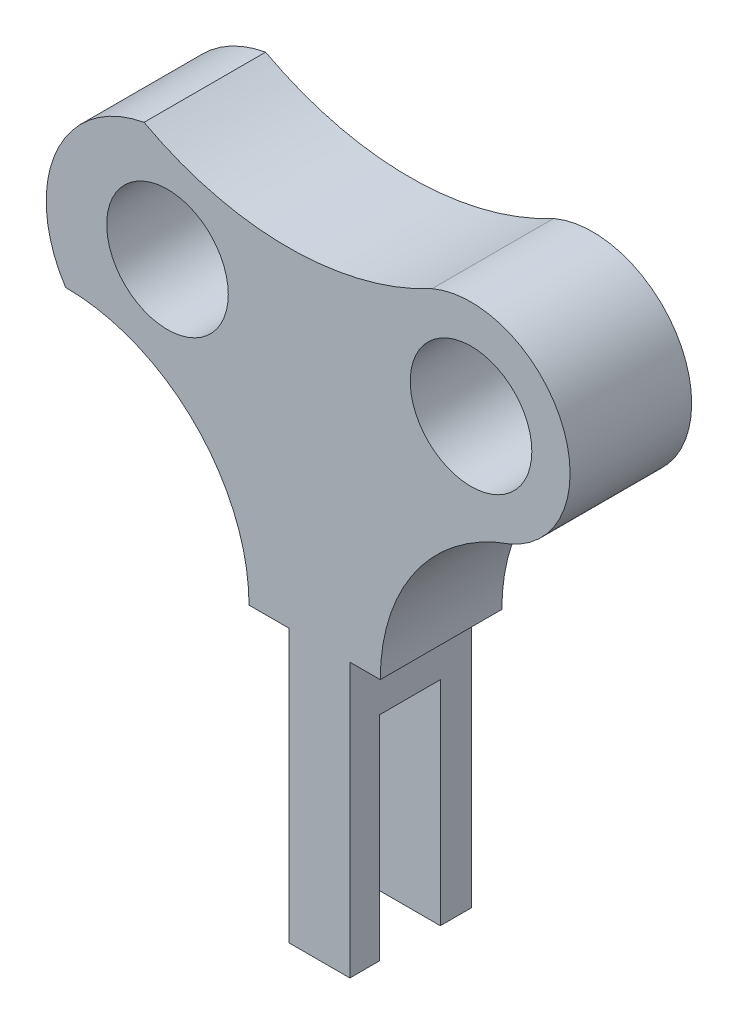
ISO-10303-21;
HEADER;
FILE_DESCRIPTION(('STEP AP214'),'2;1');
FILE_NAME('part.step','',(''),(''),'','','');
FILE_SCHEMA(('AUTOMOTIVE_DESIGN { 1 0 10303 214 1 1 1 1 }'));
ENDSEC;
DATA;
#1=APPLICATION_CONTEXT('core data for automotive mechanical design processes');
#2=APPLICATION_PROTOCOL_DEFINITION('international standard','automotive_design',2000,#1);
#3=PRODUCT_CONTEXT('',#1,'mechanical');
#4=PRODUCT('Part','Part','',(#3));
#5=PRODUCT_RELATED_PRODUCT_CATEGORY('part','',(#4));
#6=PRODUCT_DEFINITION_FORMATION('','',#4);
#7=PRODUCT_DEFINITION_CONTEXT('part definition',#1,'design');
#8=PRODUCT_DEFINITION('design','',#6,#7);
#9=PRODUCT_DEFINITION_SHAPE('','',#8);
#10=(LENGTH_UNIT() NAMED_UNIT(*) SI_UNIT(.MILLI.,.METRE.));
#11=(NAMED_UNIT(*) PLANE_ANGLE_UNIT() SI_UNIT($,.RADIAN.));
#12=(NAMED_UNIT(*) SI_UNIT($,.STERADIAN.) SOLID_ANGLE_UNIT());
#13=UNCERTAINTY_MEASURE_WITH_UNIT(LENGTH_MEASURE(1.E-05),#10,'distance_accuracy_value','');
#14=(GEOMETRIC_REPRESENTATION_CONTEXT(3) GLOBAL_UNCERTAINTY_ASSIGNED_CONTEXT((#13)) GLOBAL_UNIT_ASSIGNED_CONTEXT((#10,
#11,#12)) REPRESENTATION_CONTEXT('',''));
#15=CARTESIAN_POINT('',(0.,0.,0.));
#16=DIRECTION('',(0.,0.,1.));
#17=DIRECTION('',(1.,0.,0.));
#18=AXIS2_PLACEMENT_3D('',#15,#16,#17);
#19=CARTESIAN_POINT('',(54.8930485924395,39.6893929956681,20.));
#20=DIRECTION('',(0.,1.,0.));
#21=DIRECTION('',(0.,0.,1.));
#22=AXIS2_PLACEMENT_3D('',#19,#20,#21);
#23=PLANE('',#22);
#24=DIRECTION('',(0.,0.,-1.));
#25=VECTOR('',#24,1.);
#26=CARTESIAN_POINT('',(54.8930485924395,39.6893929956681,20.));
#27=LINE('',#26,#25);
#28=CARTESIAN_POINT('',(54.8930485924395,39.6893929956681,20.));
#29=VERTEX_POINT('',#28);
#30=CARTESIAN_POINT('',(54.8930485924395,39.6893929956681,15.1346651177182));
#31=VERTEX_POINT('',#30);
#32=EDGE_CURVE('E226',#29,#31,#27,.T.);
#33=ORIENTED_EDGE('',*,*,#32,.T.);
#34=DIRECTION('',(-1.,0.,0.));
#35=VECTOR('',#34,1.);
#36=CARTESIAN_POINT('',(74.8930485924395,39.6893929956681,15.1346651177182));
#37=LINE('',#36,#35);
#38=CARTESIAN_POINT('',(64.8930485924395,39.6893929956681,15.1346651177182));
#39=VERTEX_POINT('',#38);
#40=EDGE_CURVE('E261',#39,#31,#37,.T.);
#41=ORIENTED_EDGE('',*,*,#40,.F.);
#42=DIRECTION('',(0.,0.,-1.));
#43=VECTOR('',#42,1.);
#44=CARTESIAN_POINT('',(64.8930485924395,39.6893929956681,20.));
#45=LINE('',#44,#43);
#46=CARTESIAN_POINT('',(64.8930485924395,39.6893929956681,20.));
#47=VERTEX_POINT('',#46);
#48=EDGE_CURVE('E221',#47,#39,#45,.T.);
#49=ORIENTED_EDGE('',*,*,#48,.F.);
#50=DIRECTION('',(1.,0.,0.));
#51=VECTOR('',#50,1.);
#52=CARTESIAN_POINT('',(54.8930485924395,39.6893929956681,20.));
#53=LINE('',#52,#51);
#54=EDGE_CURVE('E112',#29,#47,#53,.T.);
#55=ORIENTED_EDGE('',*,*,#54,.F.);
#56=EDGE_LOOP('',(#33,#41,#49,#55));
#57=FACE_BOUND('',#56,.T.);
#58=ADVANCED_FACE('F39',(#57),#23,.F.);
#59=CARTESIAN_POINT('',(18.1326794520991,84.5072267477654,20.));
#60=DIRECTION('',(0.,0.,1.));
#61=DIRECTION('',(1.,0.,0.));
#62=AXIS2_PLACEMENT_3D('',#59,#60,#61);
#63=PLANE('',#62);
#64=CARTESIAN_POINT('',(84.8245600380508,129.66706374097,20.));
#65=DIRECTION('',(0.,0.,1.));
#66=DIRECTION('',(1.,0.,0.));
#67=AXIS2_PLACEMENT_3D('',#64,#65,#66);
#68=CIRCLE('',#67,10.);
#69=CARTESIAN_POINT('',(94.8245600380508,129.66706374097,20.));
#70=VERTEX_POINT('',#69);
#71=EDGE_CURVE('E171',#70,#70,#68,.T.);
#72=ORIENTED_EDGE('',*,*,#71,.F.);
#73=EDGE_LOOP('',(#72));
#74=FACE_BOUND('',#73,.T.);
#75=DIRECTION('',(0.,-1.,0.));
#76=VECTOR('',#75,1.);
#77=CARTESIAN_POINT('',(54.8930485924395,39.6893929956681,20.));
#78=LINE('',#77,#76);
#79=CARTESIAN_POINT('',(54.8930485924395,84.5072267477654,20.));
#80=VERTEX_POINT('',#79);
#81=EDGE_CURVE('E197',#80,#29,#78,.T.);
#82=ORIENTED_EDGE('',*,*,#81,.T.);
#83=ORIENTED_EDGE('',*,*,#54,.T.);
#84=DIRECTION('',(0.,1.,0.));
#85=VECTOR('',#84,1.);
#86=CARTESIAN_POINT('',(64.8930485924395,39.6893929956681,20.));
#87=LINE('',#86,#85);
#88=CARTESIAN_POINT('',(64.8930485924395,84.6893929956681,20.));
#89=VERTEX_POINT('',#88);
#90=EDGE_CURVE('E290',#47,#89,#87,.T.);
#91=ORIENTED_EDGE('',*,*,#90,.T.);
#92=DIRECTION('',(1.,0.,0.));
#93=VECTOR('',#92,1.);
#94=CARTESIAN_POINT('',(64.8930485924395,84.6893929956681,20.));
#95=LINE('',#94,#93);
#96=CARTESIAN_POINT('',(69.8930485924395,84.6893929956681,20.));
#97=VERTEX_POINT('',#96);
#98=EDGE_CURVE('E293',#89,#97,#95,.T.);
#99=ORIENTED_EDGE('',*,*,#98,.T.);
#100=CARTESIAN_POINT('',(101.644635643454,84.6893929956681,20.));
#101=DIRECTION('',(0.,0.,-1.));
#102=DIRECTION('',(-1.,0.,0.));
#103=AXIS2_PLACEMENT_3D('',#100,#101,#102);
#104=CIRCLE('',#103,31.7515870510142);
#105=CARTESIAN_POINT('',(91.2266127308357,114.683193669312,20.));
#106=VERTEX_POINT('',#105);
#107=EDGE_CURVE('E296',#97,#106,#104,.T.);
#108=ORIENTED_EDGE('',*,*,#107,.T.);
#109=CARTESIAN_POINT('',(84.8245600380508,129.66706374097,20.));
#110=DIRECTION('',(0.,0.,1.));
#111=DIRECTION('',(1.,0.,0.));
#112=AXIS2_PLACEMENT_3D('',#109,#110,#111);
#113=CIRCLE('',#112,16.29425177802);
#114=CARTESIAN_POINT('',(78.422507345266,144.650933812628,20.));
#115=VERTEX_POINT('',#114);
#116=EDGE_CURVE('E299',#106,#115,#113,.T.);
#117=ORIENTED_EDGE('',*,*,#116,.T.);
#118=CARTESIAN_POINT('',(54.7296652003077,188.681028419545,20.));
#119=DIRECTION('',(0.,0.,-1.));
#120=DIRECTION('',(1.,0.,0.));
#121=AXIS2_PLACEMENT_3D('',#118,#119,#120);
#122=CIRCLE('',#121,50.0000000000001);
#123=CARTESIAN_POINT('',(31.0368230553493,144.650933812628,20.));
#124=VERTEX_POINT('',#123);
#125=EDGE_CURVE('E141',#115,#124,#122,.T.);
#126=ORIENTED_EDGE('',*,*,#125,.T.);
#127=CARTESIAN_POINT('',(34.5196876056928,125.389068644848,20.));
#128=DIRECTION('',(0.,0.,1.));
#129=DIRECTION('',(-1.,0.,0.));
#130=AXIS2_PLACEMENT_3D('',#127,#128,#129);
#131=CIRCLE('',#130,19.574212505686);
#132=CARTESIAN_POINT('',(18.1326794520991,114.683193669312,20.));
#133=VERTEX_POINT('',#132);
#134=EDGE_CURVE('E133',#124,#133,#131,.T.);
#135=ORIENTED_EDGE('',*,*,#134,.T.);
#136=CARTESIAN_POINT('',(18.1326794520991,84.5072267477654,20.));
#137=DIRECTION('',(0.,0.,-1.));
#138=DIRECTION('',(1.,0.,0.));
#139=AXIS2_PLACEMENT_3D('',#136,#137,#138);
#140=CIRCLE('',#139,30.1759669215471);
#141=CARTESIAN_POINT('',(48.3086463736461,84.5072267477654,20.));
#142=VERTEX_POINT('',#141);
#143=EDGE_CURVE('E138',#133,#142,#140,.T.);
#144=ORIENTED_EDGE('',*,*,#143,.T.);
#145=DIRECTION('',(1.,0.,0.));
#146=VECTOR('',#145,1.);
#147=CARTESIAN_POINT('',(54.8930485924395,84.5072267477654,20.));
#148=LINE('',#147,#146);
#149=EDGE_CURVE('E64',#142,#80,#148,.T.);
#150=ORIENTED_EDGE('',*,*,#149,.T.);
#151=EDGE_LOOP('',(#82,#83,#91,#99,#108,#117,#126,#135,#144,#150));
#152=FACE_BOUND('',#151,.T.);
#153=CARTESIAN_POINT('',(34.8930485924395,127.050928278732,20.));
#154=DIRECTION('',(0.,0.,1.));
#155=DIRECTION('',(1.,0.,0.));
#156=AXIS2_PLACEMENT_3D('',#153,#154,#155);
#157=CIRCLE('',#156,10.);
#158=CARTESIAN_POINT('',(44.8930485924395,127.050928278732,20.));
#159=VERTEX_POINT('',#158);
#160=EDGE_CURVE('E266',#159,#159,#157,.T.);
#161=ORIENTED_EDGE('',*,*,#160,.F.);
#162=EDGE_LOOP('',(#161));
#163=FACE_BOUND('',#162,.T.);
#164=ADVANCED_FACE('F135',(#74,#152,#163),#63,.T.);
#165=CARTESIAN_POINT('',(18.1326794520991,84.5072267477654,0.));
#166=DIRECTION('',(0.,0.,1.));
#167=DIRECTION('',(1.,0.,0.));
#168=AXIS2_PLACEMENT_3D('',#165,#166,#167);
#169=PLANE('',#168);
#170=DIRECTION('',(0.,-1.,0.));
#171=VECTOR('',#170,1.);
#172=CARTESIAN_POINT('',(54.8930485924395,39.6893929956681,0.));
#173=LINE('',#172,#171);
#174=CARTESIAN_POINT('',(54.8930485924395,84.5072267477654,0.));
#175=VERTEX_POINT('',#174);
#176=CARTESIAN_POINT('',(54.8930485924395,39.6893929956681,0.));
#177=VERTEX_POINT('',#176);
#178=EDGE_CURVE('E166',#175,#177,#173,.T.);
#179=ORIENTED_EDGE('',*,*,#178,.F.);
#180=DIRECTION('',(1.,0.,0.));
#181=VECTOR('',#180,1.);
#182=CARTESIAN_POINT('',(54.8930485924395,84.5072267477654,0.));
#183=LINE('',#182,#181);
#184=CARTESIAN_POINT('',(48.3086463736461,84.5072267477654,0.));
#185=VERTEX_POINT('',#184);
#186=EDGE_CURVE('E103',#185,#175,#183,.T.);
#187=ORIENTED_EDGE('',*,*,#186,.F.);
#188=CARTESIAN_POINT('',(18.1326794520991,84.5072267477654,0.));
#189=DIRECTION('',(0.,0.,-1.));
#190=DIRECTION('',(1.,0.,0.));
#191=AXIS2_PLACEMENT_3D('',#188,#189,#190);
#192=CIRCLE('',#191,30.1759669215471);
#193=CARTESIAN_POINT('',(18.1326794520991,114.683193669312,0.));
#194=VERTEX_POINT('',#193);
#195=EDGE_CURVE('E192',#194,#185,#192,.T.);
#196=ORIENTED_EDGE('',*,*,#195,.F.);
#197=CARTESIAN_POINT('',(34.5196876056928,125.389068644848,0.));
#198=DIRECTION('',(0.,0.,1.));
#199=DIRECTION('',(-1.,0.,0.));
#200=AXIS2_PLACEMENT_3D('',#197,#198,#199);
#201=CIRCLE('',#200,19.574212505686);
#202=CARTESIAN_POINT('',(31.0368230553493,144.650933812628,0.));
#203=VERTEX_POINT('',#202);
#204=EDGE_CURVE('E151',#203,#194,#201,.T.);
#205=ORIENTED_EDGE('',*,*,#204,.F.);
#206=CARTESIAN_POINT('',(54.7296652003077,188.681028419545,0.));
#207=DIRECTION('',(0.,0.,-1.));
#208=DIRECTION('',(1.,0.,0.));
#209=AXIS2_PLACEMENT_3D('',#206,#207,#208);
#210=CIRCLE('',#209,50.0000000000001);
#211=CARTESIAN_POINT('',(78.422507345266,144.650933812628,0.));
#212=VERTEX_POINT('',#211);
#213=EDGE_CURVE('E187',#212,#203,#210,.T.);
#214=ORIENTED_EDGE('',*,*,#213,.F.);
#215=CARTESIAN_POINT('',(84.8245600380508,129.66706374097,0.));
#216=DIRECTION('',(0.,0.,1.));
#217=DIRECTION('',(1.,0.,0.));
#218=AXIS2_PLACEMENT_3D('',#215,#216,#217);
#219=CIRCLE('',#218,16.29425177802);
#220=CARTESIAN_POINT('',(91.2266127308357,114.683193669312,0.));
#221=VERTEX_POINT('',#220);
#222=EDGE_CURVE('E184',#221,#212,#219,.T.);
#223=ORIENTED_EDGE('',*,*,#222,.F.);
#224=CARTESIAN_POINT('',(101.644635643454,84.6893929956681,0.));
#225=DIRECTION('',(0.,0.,-1.));
#226=DIRECTION('',(-1.,0.,0.));
#227=AXIS2_PLACEMENT_3D('',#224,#225,#226);
#228=CIRCLE('',#227,31.7515870510142);
#229=CARTESIAN_POINT('',(69.8930485924395,84.6893929956681,0.));
#230=VERTEX_POINT('',#229);
#231=EDGE_CURVE('E181',#230,#221,#228,.T.);
#232=ORIENTED_EDGE('',*,*,#231,.F.);
#233=DIRECTION('',(1.,0.,0.));
#234=VECTOR('',#233,1.);
#235=CARTESIAN_POINT('',(64.8930485924395,84.6893929956681,0.));
#236=LINE('',#235,#234);
#237=CARTESIAN_POINT('',(64.8930485924395,84.6893929956681,0.));
#238=VERTEX_POINT('',#237);
#239=EDGE_CURVE('E178',#238,#230,#236,.T.);
#240=ORIENTED_EDGE('',*,*,#239,.F.);
#241=DIRECTION('',(0.,1.,0.));
#242=VECTOR('',#241,1.);
#243=CARTESIAN_POINT('',(64.8930485924395,39.6893929956681,0.));
#244=LINE('',#243,#242);
#245=CARTESIAN_POINT('',(64.8930485924395,39.6893929956681,0.));
#246=VERTEX_POINT('',#245);
#247=EDGE_CURVE('E175',#246,#238,#244,.T.);
#248=ORIENTED_EDGE('',*,*,#247,.F.);
#249=DIRECTION('',(1.,0.,0.));
#250=VECTOR('',#249,1.);
#251=CARTESIAN_POINT('',(54.8930485924395,39.6893929956681,0.));
#252=LINE('',#251,#250);
#253=EDGE_CURVE('E170',#177,#246,#252,.T.);
#254=ORIENTED_EDGE('',*,*,#253,.F.);
#255=EDGE_LOOP('',(#179,#187,#196,#205,#214,#223,#232,#240,#248,#254));
#256=FACE_BOUND('',#255,.T.);
#257=CARTESIAN_POINT('',(84.8245600380508,129.66706374097,0.));
#258=DIRECTION('',(0.,0.,1.));
#259=DIRECTION('',(1.,0.,0.));
#260=AXIS2_PLACEMENT_3D('',#257,#258,#259);
#261=CIRCLE('',#260,10.);
#262=CARTESIAN_POINT('',(94.8245600380508,129.66706374097,0.));
#263=VERTEX_POINT('',#262);
#264=EDGE_CURVE('E278',#263,#263,#261,.T.);
#265=ORIENTED_EDGE('',*,*,#264,.T.);
#266=EDGE_LOOP('',(#265));
#267=FACE_BOUND('',#266,.T.);
#268=CARTESIAN_POINT('',(34.8930485924395,127.050928278732,0.));
#269=DIRECTION('',(0.,0.,1.));
#270=DIRECTION('',(1.,0.,0.));
#271=AXIS2_PLACEMENT_3D('',#268,#269,#270);
#272=CIRCLE('',#271,10.);
#273=CARTESIAN_POINT('',(44.8930485924395,127.050928278732,0.));
#274=VERTEX_POINT('',#273);
#275=EDGE_CURVE('E260',#274,#274,#272,.T.);
#276=ORIENTED_EDGE('',*,*,#275,.T.);
#277=EDGE_LOOP('',(#276));
#278=FACE_BOUND('',#277,.T.);
#279=ADVANCED_FACE('F314',(#256,#267,#278),#169,.F.);
#280=CARTESIAN_POINT('',(54.8930485924395,39.6893929956681,20.));
#281=DIRECTION('',(1.,0.,0.));
#282=DIRECTION('',(0.,0.,-1.));
#283=AXIS2_PLACEMENT_3D('',#280,#281,#282);
#284=PLANE('',#283);
#285=DIRECTION('',(0.,0.,-1.));
#286=VECTOR('',#285,1.);
#287=CARTESIAN_POINT('',(54.8930485924395,74.7423330515118,0.));
#288=LINE('',#287,#286);
#289=CARTESIAN_POINT('',(54.8930485924395,74.7423330515118,15.1346651177182));
#290=VERTEX_POINT('',#289);
#291=CARTESIAN_POINT('',(54.8930485924395,74.7423330515118,5.11569390908967));
#292=VERTEX_POINT('',#291);
#293=EDGE_CURVE('E492',#290,#292,#288,.T.);
#294=ORIENTED_EDGE('',*,*,#293,.F.);
#295=DIRECTION('',(0.,1.,0.));
#296=VECTOR('',#295,1.);
#297=CARTESIAN_POINT('',(54.8930485924395,0.,15.1346651177182));
#298=LINE('',#297,#296);
#299=EDGE_CURVE('E257',#31,#290,#298,.T.);
#300=ORIENTED_EDGE('',*,*,#299,.F.);
#301=ORIENTED_EDGE('',*,*,#32,.F.);
#302=ORIENTED_EDGE('',*,*,#81,.F.);
#303=DIRECTION('',(0.,0.,-1.));
#304=VECTOR('',#303,1.);
#305=CARTESIAN_POINT('',(54.8930485924395,84.5072267477654,20.));
#306=LINE('',#305,#304);
#307=EDGE_CURVE('E162',#80,#175,#306,.T.);
#308=ORIENTED_EDGE('',*,*,#307,.T.);
#309=ORIENTED_EDGE('',*,*,#178,.T.);
#310=CARTESIAN_POINT('',(54.8930485924395,39.6893929956681,5.11569390908967));
#311=VERTEX_POINT('',#310);
#312=EDGE_CURVE('E225',#311,#177,#27,.T.);
#313=ORIENTED_EDGE('',*,*,#312,.F.);
#314=DIRECTION('',(0.,-1.,0.));
#315=VECTOR('',#314,1.);
#316=CARTESIAN_POINT('',(54.8930485924395,0.,5.11569390908967));
#317=LINE('',#316,#315);
#318=EDGE_CURVE('E337',#292,#311,#317,.T.);
#319=ORIENTED_EDGE('',*,*,#318,.F.);
#320=EDGE_LOOP('',(#294,#300,#301,#302,#308,#309,#313,#319));
#321=FACE_BOUND('',#320,.T.);
#322=ADVANCED_FACE('F41',(#321),#284,.F.);
#323=CARTESIAN_POINT('',(64.8930485924395,39.6893929956681,5.11569390908967));
#324=VERTEX_POINT('',#323);
#325=EDGE_CURVE('E220',#324,#246,#45,.T.);
#326=ORIENTED_EDGE('',*,*,#325,.F.);
#327=DIRECTION('',(-1.,0.,0.));
#328=VECTOR('',#327,1.);
#329=CARTESIAN_POINT('',(74.8930485924395,39.6893929956681,5.11569390908967));
#330=LINE('',#329,#328);
#331=EDGE_CURVE('E55',#324,#311,#330,.T.);
#332=ORIENTED_EDGE('',*,*,#331,.T.);
#333=ORIENTED_EDGE('',*,*,#312,.T.);
#334=ORIENTED_EDGE('',*,*,#253,.T.);
#335=EDGE_LOOP('',(#326,#332,#333,#334));
#336=FACE_BOUND('',#335,.T.);
#337=ADVANCED_FACE('F342',(#336),#23,.F.);
#338=CARTESIAN_POINT('',(64.8930485924395,39.6893929956681,20.));
#339=DIRECTION('',(-1.,0.,0.));
#340=DIRECTION('',(0.,0.,1.));
#341=AXIS2_PLACEMENT_3D('',#338,#339,#340);
#342=PLANE('',#341);
#343=ORIENTED_EDGE('',*,*,#48,.T.);
#344=DIRECTION('',(0.,1.,0.));
#345=VECTOR('',#344,1.);
#346=CARTESIAN_POINT('',(64.8930485924395,39.6893929956681,15.1346651177182));
#347=LINE('',#346,#345);
#348=CARTESIAN_POINT('',(64.8930485924395,74.7423330515118,15.1346651177182));
#349=VERTEX_POINT('',#348);
#350=EDGE_CURVE('E11',#39,#349,#347,.T.);
#351=ORIENTED_EDGE('',*,*,#350,.T.);
#352=DIRECTION('',(0.,0.,-1.));
#353=VECTOR('',#352,1.);
#354=CARTESIAN_POINT('',(64.8930485924395,74.7423330515118,20.));
#355=LINE('',#354,#353);
#356=CARTESIAN_POINT('',(64.8930485924395,74.7423330515118,5.11569390908967));
#357=VERTEX_POINT('',#356);
#358=EDGE_CURVE('E48',#349,#357,#355,.T.);
#359=ORIENTED_EDGE('',*,*,#358,.T.);
#360=DIRECTION('',(0.,-1.,0.));
#361=VECTOR('',#360,1.);
#362=CARTESIAN_POINT('',(64.8930485924395,39.6893929956681,5.11569390908967));
#363=LINE('',#362,#361);
#364=EDGE_CURVE('E229',#357,#324,#363,.T.);
#365=ORIENTED_EDGE('',*,*,#364,.T.);
#366=ORIENTED_EDGE('',*,*,#325,.T.);
#367=ORIENTED_EDGE('',*,*,#247,.T.);
#368=DIRECTION('',(0.,0.,-1.));
#369=VECTOR('',#368,1.);
#370=CARTESIAN_POINT('',(64.8930485924395,84.6893929956681,20.));
#371=LINE('',#370,#369);
#372=EDGE_CURVE('E216',#89,#238,#371,.T.);
#373=ORIENTED_EDGE('',*,*,#372,.F.);
#374=ORIENTED_EDGE('',*,*,#90,.F.);
#375=EDGE_LOOP('',(#343,#351,#359,#365,#366,#367,#373,#374));
#376=FACE_BOUND('',#375,.T.);
#377=ADVANCED_FACE('F236',(#376),#342,.F.);
#378=CARTESIAN_POINT('',(64.8930485924395,84.6893929956681,20.));
#379=DIRECTION('',(0.,1.,0.));
#380=DIRECTION('',(0.,0.,1.));
#381=AXIS2_PLACEMENT_3D('',#378,#379,#380);
#382=PLANE('',#381);
#383=ORIENTED_EDGE('',*,*,#239,.T.);
#384=DIRECTION('',(0.,0.,-1.));
#385=VECTOR('',#384,1.);
#386=CARTESIAN_POINT('',(69.8930485924395,84.6893929956681,20.));
#387=LINE('',#386,#385);
#388=EDGE_CURVE('E212',#97,#230,#387,.T.);
#389=ORIENTED_EDGE('',*,*,#388,.F.);
#390=ORIENTED_EDGE('',*,*,#98,.F.);
#391=ORIENTED_EDGE('',*,*,#372,.T.);
#392=EDGE_LOOP('',(#383,#389,#390,#391));
#393=FACE_BOUND('',#392,.T.);
#394=ADVANCED_FACE('F327',(#393),#382,.F.);
#395=CARTESIAN_POINT('',(101.644635643454,84.6893929956681,20.));
#396=DIRECTION('',(0.,0.,-1.));
#397=DIRECTION('',(-1.,0.,0.));
#398=AXIS2_PLACEMENT_3D('',#395,#396,#397);
#399=CYLINDRICAL_SURFACE('',#398,31.7515870510142);
#400=ORIENTED_EDGE('',*,*,#231,.T.);
#401=DIRECTION('',(0.,0.,-1.));
#402=VECTOR('',#401,1.);
#403=CARTESIAN_POINT('',(91.2266127308357,114.683193669312,20.));
#404=LINE('',#403,#402);
#405=EDGE_CURVE('E208',#106,#221,#404,.T.);
#406=ORIENTED_EDGE('',*,*,#405,.F.);
#407=ORIENTED_EDGE('',*,*,#107,.F.);
#408=ORIENTED_EDGE('',*,*,#388,.T.);
#409=EDGE_LOOP('',(#400,#406,#407,#408));
#410=FACE_BOUND('',#409,.T.);
#411=ADVANCED_FACE('F330',(#410),#399,.F.);
#412=CARTESIAN_POINT('',(84.8245600380508,129.66706374097,20.));
#413=DIRECTION('',(0.,0.,-1.));
#414=DIRECTION('',(-1.,0.,0.));
#415=AXIS2_PLACEMENT_3D('',#412,#413,#414);
#416=CYLINDRICAL_SURFACE('',#415,16.29425177802);
#417=ORIENTED_EDGE('',*,*,#222,.T.);
#418=DIRECTION('',(0.,0.,-1.));
#419=VECTOR('',#418,1.);
#420=CARTESIAN_POINT('',(78.422507345266,144.650933812628,20.));
#421=LINE('',#420,#419);
#422=EDGE_CURVE('E204',#115,#212,#421,.T.);
#423=ORIENTED_EDGE('',*,*,#422,.F.);
#424=ORIENTED_EDGE('',*,*,#116,.F.);
#425=ORIENTED_EDGE('',*,*,#405,.T.);
#426=EDGE_LOOP('',(#417,#423,#424,#425));
#427=FACE_BOUND('',#426,.T.);
#428=ADVANCED_FACE('F307',(#427),#416,.T.);
#429=CARTESIAN_POINT('',(54.7296652003077,188.681028419545,20.));
#430=DIRECTION('',(0.,0.,-1.));
#431=DIRECTION('',(-1.,0.,0.));
#432=AXIS2_PLACEMENT_3D('',#429,#430,#431);
#433=CYLINDRICAL_SURFACE('',#432,50.0000000000001);
#434=ORIENTED_EDGE('',*,*,#213,.T.);
#435=DIRECTION('',(0.,0.,-1.));
#436=VECTOR('',#435,1.);
#437=CARTESIAN_POINT('',(31.0368230553493,144.650933812628,20.));
#438=LINE('',#437,#436);
#439=EDGE_CURVE('E155',#124,#203,#438,.T.);
#440=ORIENTED_EDGE('',*,*,#439,.F.);
#441=ORIENTED_EDGE('',*,*,#125,.F.);
#442=ORIENTED_EDGE('',*,*,#422,.T.);
#443=EDGE_LOOP('',(#434,#440,#441,#442));
#444=FACE_BOUND('',#443,.T.);
#445=ADVANCED_FACE('F311',(#444),#433,.F.);
#446=CARTESIAN_POINT('',(34.5196876056928,125.389068644848,20.));
#447=DIRECTION('',(0.,0.,-1.));
#448=DIRECTION('',(-1.,0.,0.));
#449=AXIS2_PLACEMENT_3D('',#446,#447,#448);
#450=CYLINDRICAL_SURFACE('',#449,19.574212505686);
#451=ORIENTED_EDGE('',*,*,#204,.T.);
#452=DIRECTION('',(0.,0.,-1.));
#453=VECTOR('',#452,1.);
#454=CARTESIAN_POINT('',(18.1326794520991,114.683193669312,20.));
#455=LINE('',#454,#453);
#456=EDGE_CURVE('E148',#133,#194,#455,.T.);
#457=ORIENTED_EDGE('',*,*,#456,.F.);
#458=ORIENTED_EDGE('',*,*,#134,.F.);
#459=ORIENTED_EDGE('',*,*,#439,.T.);
#460=EDGE_LOOP('',(#451,#457,#458,#459));
#461=FACE_BOUND('',#460,.T.);
#462=ADVANCED_FACE('F149',(#461),#450,.T.);
#463=CARTESIAN_POINT('',(18.1326794520991,84.5072267477654,20.));
#464=DIRECTION('',(0.,0.,-1.));
#465=DIRECTION('',(-1.,0.,0.));
#466=AXIS2_PLACEMENT_3D('',#463,#464,#465);
#467=CYLINDRICAL_SURFACE('',#466,30.1759669215471);
#468=ORIENTED_EDGE('',*,*,#195,.T.);
#469=DIRECTION('',(0.,0.,-1.));
#470=VECTOR('',#469,1.);
#471=CARTESIAN_POINT('',(48.3086463736461,84.5072267477654,20.));
#472=LINE('',#471,#470);
#473=EDGE_CURVE('E156',#142,#185,#472,.T.);
#474=ORIENTED_EDGE('',*,*,#473,.F.);
#475=ORIENTED_EDGE('',*,*,#143,.F.);
#476=ORIENTED_EDGE('',*,*,#456,.T.);
#477=EDGE_LOOP('',(#468,#474,#475,#476));
#478=FACE_BOUND('',#477,.T.);
#479=ADVANCED_FACE('F158',(#478),#467,.F.);
#480=CARTESIAN_POINT('',(54.8930485924395,84.5072267477654,20.));
#481=DIRECTION('',(0.,1.,0.));
#482=DIRECTION('',(0.,0.,1.));
#483=AXIS2_PLACEMENT_3D('',#480,#481,#482);
#484=PLANE('',#483);
#485=ORIENTED_EDGE('',*,*,#186,.T.);
#486=ORIENTED_EDGE('',*,*,#307,.F.);
#487=ORIENTED_EDGE('',*,*,#149,.F.);
#488=ORIENTED_EDGE('',*,*,#473,.T.);
#489=EDGE_LOOP('',(#485,#486,#487,#488));
#490=FACE_BOUND('',#489,.T.);
#491=ADVANCED_FACE('F316',(#490),#484,.F.);
#492=CARTESIAN_POINT('',(84.8245600380508,129.66706374097,20.));
#493=DIRECTION('',(0.,0.,-1.));
#494=DIRECTION('',(-1.,0.,0.));
#495=AXIS2_PLACEMENT_3D('',#492,#493,#494);
#496=CYLINDRICAL_SURFACE('',#495,10.);
#497=ORIENTED_EDGE('',*,*,#71,.T.);
#498=EDGE_LOOP('',(#497));
#499=FACE_BOUND('',#498,.T.);
#500=ORIENTED_EDGE('',*,*,#264,.F.);
#501=EDGE_LOOP('',(#500));
#502=FACE_BOUND('',#501,.T.);
#503=ADVANCED_FACE('F361',(#499,#502),#496,.F.);
#504=CARTESIAN_POINT('',(34.8930485924395,127.050928278732,20.));
#505=DIRECTION('',(0.,0.,-1.));
#506=DIRECTION('',(-1.,0.,0.));
#507=AXIS2_PLACEMENT_3D('',#504,#505,#506);
#508=CYLINDRICAL_SURFACE('',#507,10.);
#509=ORIENTED_EDGE('',*,*,#160,.T.);
#510=EDGE_LOOP('',(#509));
#511=FACE_BOUND('',#510,.T.);
#512=ORIENTED_EDGE('',*,*,#275,.F.);
#513=EDGE_LOOP('',(#512));
#514=FACE_BOUND('',#513,.T.);
#515=ADVANCED_FACE('F412',(#511,#514),#508,.F.);
#516=CARTESIAN_POINT('',(74.8930485924395,74.7423330515118,0.));
#517=DIRECTION('',(0.,1.,0.));
#518=DIRECTION('',(0.,0.,1.));
#519=AXIS2_PLACEMENT_3D('',#516,#517,#518);
#520=PLANE('',#519);
#521=DIRECTION('',(-1.,0.,0.));
#522=VECTOR('',#521,1.);
#523=CARTESIAN_POINT('',(74.8930485924395,74.7423330515118,15.1346651177182));
#524=LINE('',#523,#522);
#525=EDGE_CURVE('E248',#349,#290,#524,.T.);
#526=ORIENTED_EDGE('',*,*,#525,.T.);
#527=ORIENTED_EDGE('',*,*,#293,.T.);
#528=DIRECTION('',(-1.,0.,0.));
#529=VECTOR('',#528,1.);
#530=CARTESIAN_POINT('',(74.8930485924395,74.7423330515118,5.11569390908967));
#531=LINE('',#530,#529);
#532=EDGE_CURVE('E251',#357,#292,#531,.T.);
#533=ORIENTED_EDGE('',*,*,#532,.F.);
#534=ORIENTED_EDGE('',*,*,#358,.F.);
#535=EDGE_LOOP('',(#526,#527,#533,#534));
#536=FACE_BOUND('',#535,.T.);
#537=ADVANCED_FACE('F246',(#536),#520,.F.);
#538=CARTESIAN_POINT('',(74.8930485924395,0.,15.1346651177182));
#539=DIRECTION('',(0.,0.,1.));
#540=DIRECTION('',(1.,0.,0.));
#541=AXIS2_PLACEMENT_3D('',#538,#539,#540);
#542=PLANE('',#541);
#543=ORIENTED_EDGE('',*,*,#40,.T.);
#544=ORIENTED_EDGE('',*,*,#299,.T.);
#545=ORIENTED_EDGE('',*,*,#525,.F.);
#546=ORIENTED_EDGE('',*,*,#350,.F.);
#547=EDGE_LOOP('',(#543,#544,#545,#546));
#548=FACE_BOUND('',#547,.T.);
#549=ADVANCED_FACE('F254',(#548),#542,.F.);
#550=CARTESIAN_POINT('',(74.8930485924395,0.,5.11569390908967));
#551=DIRECTION('',(0.,0.,-1.));
#552=DIRECTION('',(-1.,0.,0.));
#553=AXIS2_PLACEMENT_3D('',#550,#551,#552);
#554=PLANE('',#553);
#555=ORIENTED_EDGE('',*,*,#532,.T.);
#556=ORIENTED_EDGE('',*,*,#318,.T.);
#557=ORIENTED_EDGE('',*,*,#331,.F.);
#558=ORIENTED_EDGE('',*,*,#364,.F.);
#559=EDGE_LOOP('',(#555,#556,#557,#558));
#560=FACE_BOUND('',#559,.T.);
#561=ADVANCED_FACE('F431',(#560),#554,.F.);
#562=CLOSED_SHELL('',(#58,#164,#279,#322,#337,#377,#394,#411,#428,#445,#462,#479,#491,#503,#515,
#537,#549,#561));
#563=MANIFOLD_SOLID_BREP('B2',#562);
#564=ADVANCED_BREP_SHAPE_REPRESENTATION('',(#18,#563),#14);
#565=SHAPE_DEFINITION_REPRESENTATION(#9,#564);
ENDSEC;
END-ISO-10303-21;
